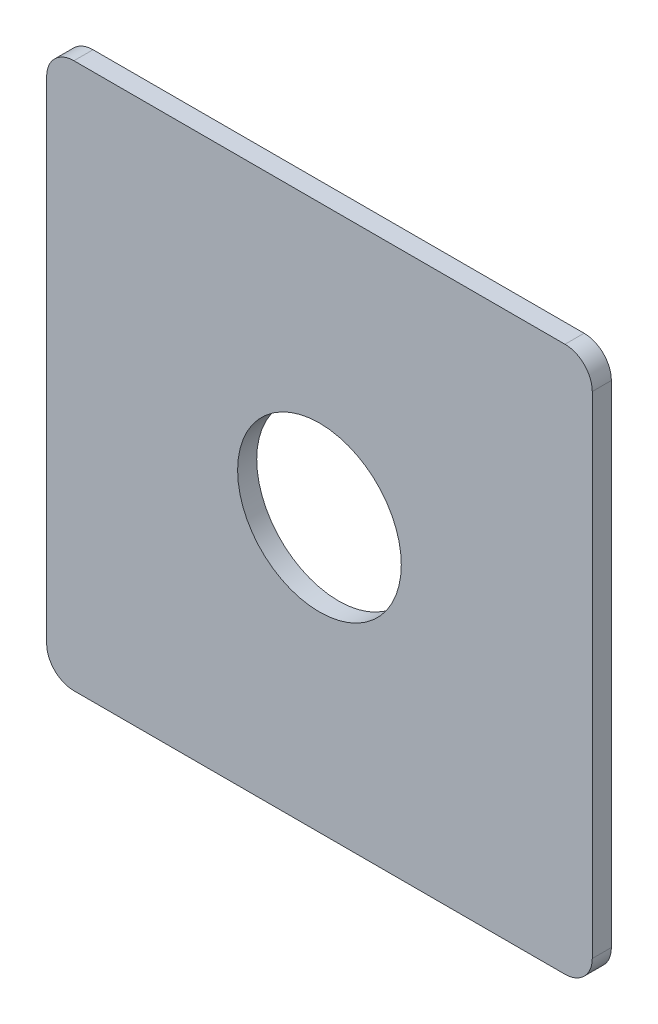
ISO-10303-21;
HEADER;
FILE_DESCRIPTION(('STEP AP214'),'2;1');
FILE_NAME('part.step','',(''),(''),'','','');
FILE_SCHEMA(('AUTOMOTIVE_DESIGN { 1 0 10303 214 1 1 1 1 }'));
ENDSEC;
DATA;
#1=APPLICATION_CONTEXT('core data for automotive mechanical design processes');
#2=APPLICATION_PROTOCOL_DEFINITION('international standard','automotive_design',2000,#1);
#3=PRODUCT_CONTEXT('',#1,'mechanical');
#4=PRODUCT('Part','Part','',(#3));
#5=PRODUCT_RELATED_PRODUCT_CATEGORY('part','',(#4));
#6=PRODUCT_DEFINITION_FORMATION('','',#4);
#7=PRODUCT_DEFINITION_CONTEXT('part definition',#1,'design');
#8=PRODUCT_DEFINITION('design','',#6,#7);
#9=PRODUCT_DEFINITION_SHAPE('','',#8);
#10=(LENGTH_UNIT() NAMED_UNIT(*) SI_UNIT(.MILLI.,.METRE.));
#11=(NAMED_UNIT(*) PLANE_ANGLE_UNIT() SI_UNIT($,.RADIAN.));
#12=(NAMED_UNIT(*) SI_UNIT($,.STERADIAN.) SOLID_ANGLE_UNIT());
#13=UNCERTAINTY_MEASURE_WITH_UNIT(LENGTH_MEASURE(1.E-05),#10,'distance_accuracy_value','');
#14=(GEOMETRIC_REPRESENTATION_CONTEXT(3) GLOBAL_UNCERTAINTY_ASSIGNED_CONTEXT((#13)) GLOBAL_UNIT_ASSIGNED_CONTEXT((#10,
#11,#12)) REPRESENTATION_CONTEXT('',''));
#15=CARTESIAN_POINT('',(0.,0.,0.));
#16=DIRECTION('',(0.,0.,1.));
#17=DIRECTION('',(1.,0.,0.));
#18=AXIS2_PLACEMENT_3D('',#15,#16,#17);
#19=CARTESIAN_POINT('',(0.,0.,-31.9));
#20=DIRECTION('',(0.,0.,1.));
#21=DIRECTION('',(1.,0.,0.));
#22=AXIS2_PLACEMENT_3D('',#19,#20,#21);
#23=PLANE('',#22);
#24=CARTESIAN_POINT('',(0.,0.,-31.9));
#25=DIRECTION('',(0.,0.,-1.));
#26=DIRECTION('',(1.,0.,0.));
#27=AXIS2_PLACEMENT_3D('',#24,#25,#26);
#28=CIRCLE('',#27,6.);
#29=CARTESIAN_POINT('',(-6.,0.,-31.9));
#30=VERTEX_POINT('',#29);
#31=EDGE_CURVE('E272',#30,#30,#28,.T.);
#32=ORIENTED_EDGE('',*,*,#31,.T.);
#33=EDGE_LOOP('',(#32));
#34=FACE_BOUND('',#33,.T.);
#35=CARTESIAN_POINT('',(-18.,-18.,-31.9));
#36=DIRECTION('',(0.,0.,1.));
#37=DIRECTION('',(-0.707106781186548,-0.707106781186548,0.));
#38=AXIS2_PLACEMENT_3D('',#35,#36,#37);
#39=CIRCLE('',#38,2.);
#40=CARTESIAN_POINT('',(-20.,-18.,-31.9));
#41=VERTEX_POINT('',#40);
#42=CARTESIAN_POINT('',(-18.,-20.,-31.9));
#43=VERTEX_POINT('',#42);
#44=EDGE_CURVE('E11',#41,#43,#39,.T.);
#45=ORIENTED_EDGE('',*,*,#44,.T.);
#46=DIRECTION('',(1.,0.,0.));
#47=VECTOR('',#46,1.);
#48=CARTESIAN_POINT('',(-10.,-20.,-31.9));
#49=LINE('',#48,#47);
#50=CARTESIAN_POINT('',(18.,-20.,-31.9));
#51=VERTEX_POINT('',#50);
#52=EDGE_CURVE('E189',#43,#51,#49,.T.);
#53=ORIENTED_EDGE('',*,*,#52,.T.);
#54=CARTESIAN_POINT('',(18.,-18.,-31.9));
#55=DIRECTION('',(0.,0.,1.));
#56=DIRECTION('',(0.707106781186548,-0.707106781186548,0.));
#57=AXIS2_PLACEMENT_3D('',#54,#55,#56);
#58=CIRCLE('',#57,2.);
#59=CARTESIAN_POINT('',(20.,-18.,-31.9));
#60=VERTEX_POINT('',#59);
#61=EDGE_CURVE('E177',#51,#60,#58,.T.);
#62=ORIENTED_EDGE('',*,*,#61,.T.);
#63=DIRECTION('',(0.,1.,0.));
#64=VECTOR('',#63,1.);
#65=CARTESIAN_POINT('',(20.,-10.,-31.9));
#66=LINE('',#65,#64);
#67=CARTESIAN_POINT('',(20.,18.,-31.9));
#68=VERTEX_POINT('',#67);
#69=EDGE_CURVE('E198',#60,#68,#66,.T.);
#70=ORIENTED_EDGE('',*,*,#69,.T.);
#71=CARTESIAN_POINT('',(18.,18.,-31.9));
#72=DIRECTION('',(0.,0.,1.));
#73=DIRECTION('',(0.707106781186548,0.707106781186548,0.));
#74=AXIS2_PLACEMENT_3D('',#71,#72,#73);
#75=CIRCLE('',#74,2.);
#76=CARTESIAN_POINT('',(18.,20.,-31.9));
#77=VERTEX_POINT('',#76);
#78=EDGE_CURVE('E150',#68,#77,#75,.T.);
#79=ORIENTED_EDGE('',*,*,#78,.T.);
#80=DIRECTION('',(-1.,0.,0.));
#81=VECTOR('',#80,1.);
#82=CARTESIAN_POINT('',(10.,20.,-31.9));
#83=LINE('',#82,#81);
#84=CARTESIAN_POINT('',(-18.,20.,-31.9));
#85=VERTEX_POINT('',#84);
#86=EDGE_CURVE('E146',#77,#85,#83,.T.);
#87=ORIENTED_EDGE('',*,*,#86,.T.);
#88=CARTESIAN_POINT('',(-18.,18.,-31.9));
#89=DIRECTION('',(0.,0.,1.));
#90=DIRECTION('',(-0.707106781186548,0.707106781186548,0.));
#91=AXIS2_PLACEMENT_3D('',#88,#89,#90);
#92=CIRCLE('',#91,2.);
#93=CARTESIAN_POINT('',(-20.,18.,-31.9));
#94=VERTEX_POINT('',#93);
#95=EDGE_CURVE('E211',#85,#94,#92,.T.);
#96=ORIENTED_EDGE('',*,*,#95,.T.);
#97=DIRECTION('',(0.,-1.,0.));
#98=VECTOR('',#97,1.);
#99=CARTESIAN_POINT('',(-20.,10.,-31.9));
#100=LINE('',#99,#98);
#101=EDGE_CURVE('E72',#94,#41,#100,.T.);
#102=ORIENTED_EDGE('',*,*,#101,.T.);
#103=EDGE_LOOP('',(#45,#53,#62,#70,#79,#87,#96,#102));
#104=FACE_BOUND('',#103,.T.);
#105=ADVANCED_FACE('F45',(#34,#104),#23,.T.);
#106=CARTESIAN_POINT('',(-18.,-18.,-31.9));
#107=DIRECTION('',(0.,0.,-1.));
#108=DIRECTION('',(-0.707106781186548,-0.707106781186548,0.));
#109=AXIS2_PLACEMENT_3D('',#106,#107,#108);
#110=CYLINDRICAL_SURFACE('',#109,2.);
#111=ORIENTED_EDGE('',*,*,#44,.F.);
#112=DIRECTION('',(0.,0.,-1.));
#113=VECTOR('',#112,1.);
#114=CARTESIAN_POINT('',(-20.,-18.,-31.9));
#115=LINE('',#114,#113);
#116=CARTESIAN_POINT('',(-20.,-18.,-33.3));
#117=VERTEX_POINT('',#116);
#118=EDGE_CURVE('E54',#41,#117,#115,.T.);
#119=ORIENTED_EDGE('',*,*,#118,.T.);
#120=CARTESIAN_POINT('',(-18.,-18.,-33.3));
#121=DIRECTION('',(0.,0.,-1.));
#122=DIRECTION('',(-0.707106781186548,-0.707106781186548,0.));
#123=AXIS2_PLACEMENT_3D('',#120,#121,#122);
#124=CIRCLE('',#123,2.);
#125=CARTESIAN_POINT('',(-18.,-20.,-33.3));
#126=VERTEX_POINT('',#125);
#127=EDGE_CURVE('E221',#126,#117,#124,.T.);
#128=ORIENTED_EDGE('',*,*,#127,.F.);
#129=DIRECTION('',(0.,0.,-1.));
#130=VECTOR('',#129,1.);
#131=CARTESIAN_POINT('',(-18.,-20.,-31.9));
#132=LINE('',#131,#130);
#133=EDGE_CURVE('E193',#43,#126,#132,.T.);
#134=ORIENTED_EDGE('',*,*,#133,.F.);
#135=EDGE_LOOP('',(#111,#119,#128,#134));
#136=FACE_BOUND('',#135,.T.);
#137=ADVANCED_FACE('F47',(#136),#110,.T.);
#138=CARTESIAN_POINT('',(-20.,-18.,-31.9));
#139=DIRECTION('',(-1.,0.,0.));
#140=DIRECTION('',(0.,0.,1.));
#141=AXIS2_PLACEMENT_3D('',#138,#139,#140);
#142=PLANE('',#141);
#143=ORIENTED_EDGE('',*,*,#101,.F.);
#144=DIRECTION('',(0.,0.,-1.));
#145=VECTOR('',#144,1.);
#146=CARTESIAN_POINT('',(-20.,18.,-31.9));
#147=LINE('',#146,#145);
#148=CARTESIAN_POINT('',(-20.,18.,-33.3));
#149=VERTEX_POINT('',#148);
#150=EDGE_CURVE('E215',#94,#149,#147,.T.);
#151=ORIENTED_EDGE('',*,*,#150,.T.);
#152=DIRECTION('',(0.,1.,0.));
#153=VECTOR('',#152,1.);
#154=CARTESIAN_POINT('',(-20.,10.,-33.3));
#155=LINE('',#154,#153);
#156=EDGE_CURVE('E173',#117,#149,#155,.T.);
#157=ORIENTED_EDGE('',*,*,#156,.F.);
#158=ORIENTED_EDGE('',*,*,#118,.F.);
#159=EDGE_LOOP('',(#143,#151,#157,#158));
#160=FACE_BOUND('',#159,.T.);
#161=ADVANCED_FACE('F222',(#160),#142,.T.);
#162=CARTESIAN_POINT('',(-18.,18.,-31.9));
#163=DIRECTION('',(0.,0.,-1.));
#164=DIRECTION('',(-0.707106781186548,0.707106781186548,0.));
#165=AXIS2_PLACEMENT_3D('',#162,#163,#164);
#166=CYLINDRICAL_SURFACE('',#165,2.);
#167=ORIENTED_EDGE('',*,*,#95,.F.);
#168=DIRECTION('',(0.,0.,-1.));
#169=VECTOR('',#168,1.);
#170=CARTESIAN_POINT('',(-18.,20.,-31.9));
#171=LINE('',#170,#169);
#172=CARTESIAN_POINT('',(-18.,20.,-33.3));
#173=VERTEX_POINT('',#172);
#174=EDGE_CURVE('E208',#85,#173,#171,.T.);
#175=ORIENTED_EDGE('',*,*,#174,.T.);
#176=CARTESIAN_POINT('',(-18.,18.,-33.3));
#177=DIRECTION('',(0.,0.,-1.));
#178=DIRECTION('',(-0.707106781186548,0.707106781186548,0.));
#179=AXIS2_PLACEMENT_3D('',#176,#177,#178);
#180=CIRCLE('',#179,2.);
#181=EDGE_CURVE('E167',#149,#173,#180,.T.);
#182=ORIENTED_EDGE('',*,*,#181,.F.);
#183=ORIENTED_EDGE('',*,*,#150,.F.);
#184=EDGE_LOOP('',(#167,#175,#182,#183));
#185=FACE_BOUND('',#184,.T.);
#186=ADVANCED_FACE('F253',(#185),#166,.T.);
#187=CARTESIAN_POINT('',(-18.,20.,-31.9));
#188=DIRECTION('',(0.,1.,0.));
#189=DIRECTION('',(1.,0.,0.));
#190=AXIS2_PLACEMENT_3D('',#187,#188,#189);
#191=PLANE('',#190);
#192=ORIENTED_EDGE('',*,*,#86,.F.);
#193=DIRECTION('',(0.,0.,-1.));
#194=VECTOR('',#193,1.);
#195=CARTESIAN_POINT('',(18.,20.,-31.9));
#196=LINE('',#195,#194);
#197=CARTESIAN_POINT('',(18.,20.,-33.3));
#198=VERTEX_POINT('',#197);
#199=EDGE_CURVE('E138',#77,#198,#196,.T.);
#200=ORIENTED_EDGE('',*,*,#199,.T.);
#201=DIRECTION('',(1.,0.,0.));
#202=VECTOR('',#201,1.);
#203=CARTESIAN_POINT('',(10.,20.,-33.3));
#204=LINE('',#203,#202);
#205=EDGE_CURVE('E143',#173,#198,#204,.T.);
#206=ORIENTED_EDGE('',*,*,#205,.F.);
#207=ORIENTED_EDGE('',*,*,#174,.F.);
#208=EDGE_LOOP('',(#192,#200,#206,#207));
#209=FACE_BOUND('',#208,.T.);
#210=ADVANCED_FACE('F140',(#209),#191,.T.);
#211=CARTESIAN_POINT('',(18.,18.,-31.9));
#212=DIRECTION('',(0.,0.,-1.));
#213=DIRECTION('',(0.707106781186548,0.707106781186548,0.));
#214=AXIS2_PLACEMENT_3D('',#211,#212,#213);
#215=CYLINDRICAL_SURFACE('',#214,2.);
#216=ORIENTED_EDGE('',*,*,#78,.F.);
#217=DIRECTION('',(0.,0.,-1.));
#218=VECTOR('',#217,1.);
#219=CARTESIAN_POINT('',(20.,18.,-31.9));
#220=LINE('',#219,#218);
#221=CARTESIAN_POINT('',(20.,18.,-33.3));
#222=VERTEX_POINT('',#221);
#223=EDGE_CURVE('E156',#68,#222,#220,.T.);
#224=ORIENTED_EDGE('',*,*,#223,.T.);
#225=CARTESIAN_POINT('',(18.,18.,-33.3));
#226=DIRECTION('',(0.,0.,-1.));
#227=DIRECTION('',(0.707106781186548,0.707106781186548,0.));
#228=AXIS2_PLACEMENT_3D('',#225,#226,#227);
#229=CIRCLE('',#228,2.);
#230=EDGE_CURVE('E153',#198,#222,#229,.T.);
#231=ORIENTED_EDGE('',*,*,#230,.F.);
#232=ORIENTED_EDGE('',*,*,#199,.F.);
#233=EDGE_LOOP('',(#216,#224,#231,#232));
#234=FACE_BOUND('',#233,.T.);
#235=ADVANCED_FACE('F154',(#234),#215,.T.);
#236=CARTESIAN_POINT('',(20.,18.,-31.9));
#237=DIRECTION('',(1.,0.,0.));
#238=DIRECTION('',(0.,1.,0.));
#239=AXIS2_PLACEMENT_3D('',#236,#237,#238);
#240=PLANE('',#239);
#241=ORIENTED_EDGE('',*,*,#69,.F.);
#242=DIRECTION('',(0.,0.,-1.));
#243=VECTOR('',#242,1.);
#244=CARTESIAN_POINT('',(20.,-18.,-31.9));
#245=LINE('',#244,#243);
#246=CARTESIAN_POINT('',(20.,-18.,-33.3));
#247=VERTEX_POINT('',#246);
#248=EDGE_CURVE('E180',#60,#247,#245,.T.);
#249=ORIENTED_EDGE('',*,*,#248,.T.);
#250=DIRECTION('',(0.,-1.,0.));
#251=VECTOR('',#250,1.);
#252=CARTESIAN_POINT('',(20.,-10.,-33.3));
#253=LINE('',#252,#251);
#254=EDGE_CURVE('E161',#222,#247,#253,.T.);
#255=ORIENTED_EDGE('',*,*,#254,.F.);
#256=ORIENTED_EDGE('',*,*,#223,.F.);
#257=EDGE_LOOP('',(#241,#249,#255,#256));
#258=FACE_BOUND('',#257,.T.);
#259=ADVANCED_FACE('F295',(#258),#240,.T.);
#260=CARTESIAN_POINT('',(18.,-18.,-31.9));
#261=DIRECTION('',(0.,0.,-1.));
#262=DIRECTION('',(0.707106781186548,-0.707106781186548,0.));
#263=AXIS2_PLACEMENT_3D('',#260,#261,#262);
#264=CYLINDRICAL_SURFACE('',#263,2.);
#265=ORIENTED_EDGE('',*,*,#61,.F.);
#266=DIRECTION('',(0.,0.,-1.));
#267=VECTOR('',#266,1.);
#268=CARTESIAN_POINT('',(18.,-20.,-31.9));
#269=LINE('',#268,#267);
#270=CARTESIAN_POINT('',(18.,-20.,-33.3));
#271=VERTEX_POINT('',#270);
#272=EDGE_CURVE('E181',#51,#271,#269,.T.);
#273=ORIENTED_EDGE('',*,*,#272,.T.);
#274=CARTESIAN_POINT('',(18.,-18.,-33.3));
#275=DIRECTION('',(0.,0.,-1.));
#276=DIRECTION('',(0.707106781186548,-0.707106781186548,0.));
#277=AXIS2_PLACEMENT_3D('',#274,#275,#276);
#278=CIRCLE('',#277,2.);
#279=EDGE_CURVE('E184',#247,#271,#278,.T.);
#280=ORIENTED_EDGE('',*,*,#279,.F.);
#281=ORIENTED_EDGE('',*,*,#248,.F.);
#282=EDGE_LOOP('',(#265,#273,#280,#281));
#283=FACE_BOUND('',#282,.T.);
#284=ADVANCED_FACE('F290',(#283),#264,.T.);
#285=CARTESIAN_POINT('',(18.,-20.,-31.9));
#286=DIRECTION('',(0.,-1.,0.));
#287=DIRECTION('',(0.,0.,-1.));
#288=AXIS2_PLACEMENT_3D('',#285,#286,#287);
#289=PLANE('',#288);
#290=ORIENTED_EDGE('',*,*,#52,.F.);
#291=ORIENTED_EDGE('',*,*,#133,.T.);
#292=DIRECTION('',(-1.,0.,0.));
#293=VECTOR('',#292,1.);
#294=CARTESIAN_POINT('',(-10.,-20.,-33.3));
#295=LINE('',#294,#293);
#296=EDGE_CURVE('E185',#271,#126,#295,.T.);
#297=ORIENTED_EDGE('',*,*,#296,.F.);
#298=ORIENTED_EDGE('',*,*,#272,.F.);
#299=EDGE_LOOP('',(#290,#291,#297,#298));
#300=FACE_BOUND('',#299,.T.);
#301=ADVANCED_FACE('F249',(#300),#289,.T.);
#302=CARTESIAN_POINT('',(0.,0.,-33.3));
#303=DIRECTION('',(0.,0.,1.));
#304=DIRECTION('',(1.,0.,0.));
#305=AXIS2_PLACEMENT_3D('',#302,#303,#304);
#306=PLANE('',#305);
#307=CARTESIAN_POINT('',(0.,0.,-33.3));
#308=DIRECTION('',(0.,0.,1.));
#309=DIRECTION('',(1.,0.,0.));
#310=AXIS2_PLACEMENT_3D('',#307,#308,#309);
#311=CIRCLE('',#310,6.);
#312=CARTESIAN_POINT('',(-6.,0.,-33.3));
#313=VERTEX_POINT('',#312);
#314=EDGE_CURVE('E228',#313,#313,#311,.T.);
#315=ORIENTED_EDGE('',*,*,#314,.T.);
#316=EDGE_LOOP('',(#315));
#317=FACE_BOUND('',#316,.T.);
#318=ORIENTED_EDGE('',*,*,#127,.T.);
#319=ORIENTED_EDGE('',*,*,#156,.T.);
#320=ORIENTED_EDGE('',*,*,#181,.T.);
#321=ORIENTED_EDGE('',*,*,#205,.T.);
#322=ORIENTED_EDGE('',*,*,#230,.T.);
#323=ORIENTED_EDGE('',*,*,#254,.T.);
#324=ORIENTED_EDGE('',*,*,#279,.T.);
#325=ORIENTED_EDGE('',*,*,#296,.T.);
#326=EDGE_LOOP('',(#318,#319,#320,#321,#322,#323,#324,#325));
#327=FACE_BOUND('',#326,.T.);
#328=ADVANCED_FACE('F164',(#317,#327),#306,.F.);
#329=CARTESIAN_POINT('',(0.,0.,-33.3));
#330=DIRECTION('',(0.,0.,1.));
#331=DIRECTION('',(1.,0.,0.));
#332=AXIS2_PLACEMENT_3D('',#329,#330,#331);
#333=CYLINDRICAL_SURFACE('',#332,6.);
#334=ORIENTED_EDGE('',*,*,#31,.F.);
#335=DIRECTION('',(0.,0.,-1.));
#336=VECTOR('',#335,1.);
#337=CARTESIAN_POINT('',(-6.,0.,-33.3));
#338=LINE('',#337,#336);
#339=EDGE_CURVE('E233',#30,#313,#338,.T.);
#340=ORIENTED_EDGE('',*,*,#339,.T.);
#341=ORIENTED_EDGE('',*,*,#314,.F.);
#342=ORIENTED_EDGE('',*,*,#339,.F.);
#343=EDGE_LOOP('',(#334,#340,#341,#342));
#344=FACE_BOUND('',#343,.T.);
#345=ADVANCED_FACE('F280',(#344),#333,.F.);
#346=CLOSED_SHELL('',(#105,#137,#161,#186,#210,#235,#259,#284,#301,#328,#345));
#347=MANIFOLD_SOLID_BREP('B2',#346);
#348=ADVANCED_BREP_SHAPE_REPRESENTATION('',(#18,#347),#14);
#349=SHAPE_DEFINITION_REPRESENTATION(#9,#348);
ENDSEC;
END-ISO-10303-21;
